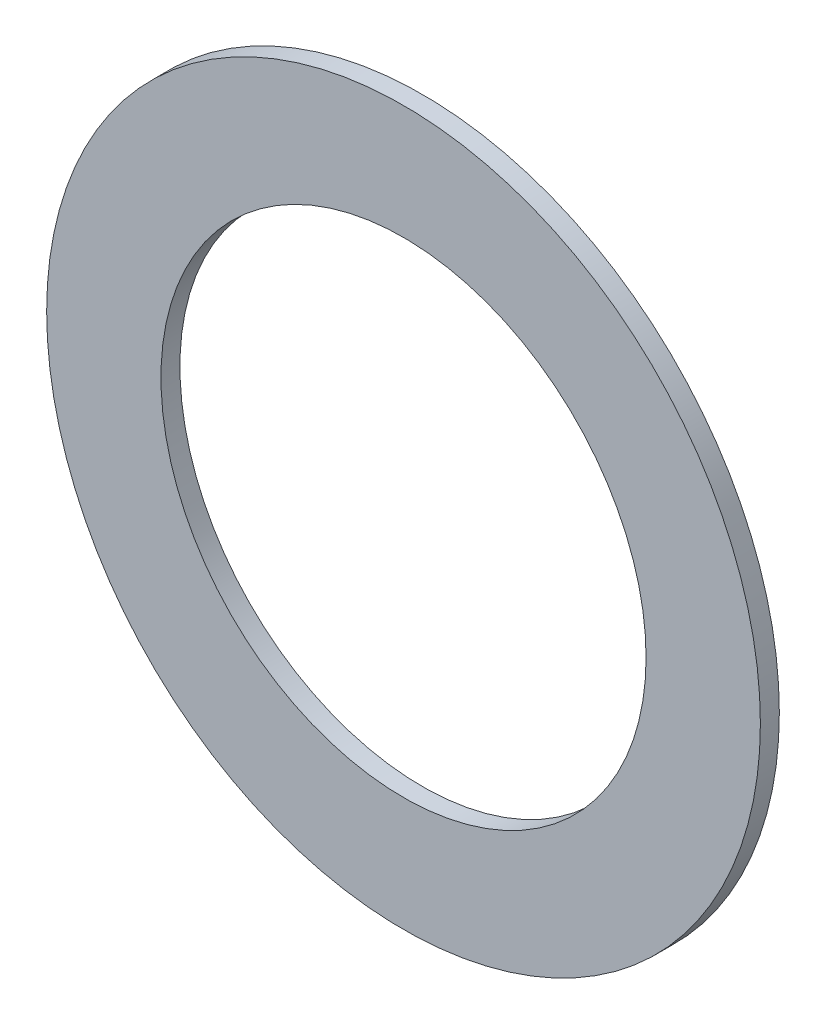
ISO-10303-21;
HEADER;
FILE_DESCRIPTION(('STEP AP214'),'2;1');
FILE_NAME('part.step','',(''),(''),'','','');
FILE_SCHEMA(('AUTOMOTIVE_DESIGN { 1 0 10303 214 1 1 1 1 }'));
ENDSEC;
DATA;
#1=APPLICATION_CONTEXT('core data for automotive mechanical design processes');
#2=APPLICATION_PROTOCOL_DEFINITION('international standard','automotive_design',2000,#1);
#3=PRODUCT_CONTEXT('',#1,'mechanical');
#4=PRODUCT('Part','Part','',(#3));
#5=PRODUCT_RELATED_PRODUCT_CATEGORY('part','',(#4));
#6=PRODUCT_DEFINITION_FORMATION('','',#4);
#7=PRODUCT_DEFINITION_CONTEXT('part definition',#1,'design');
#8=PRODUCT_DEFINITION('design','',#6,#7);
#9=PRODUCT_DEFINITION_SHAPE('','',#8);
#10=(LENGTH_UNIT() NAMED_UNIT(*) SI_UNIT(.MILLI.,.METRE.));
#11=(NAMED_UNIT(*) PLANE_ANGLE_UNIT() SI_UNIT($,.RADIAN.));
#12=(NAMED_UNIT(*) SI_UNIT($,.STERADIAN.) SOLID_ANGLE_UNIT());
#13=UNCERTAINTY_MEASURE_WITH_UNIT(LENGTH_MEASURE(1.E-05),#10,'distance_accuracy_value','');
#14=(GEOMETRIC_REPRESENTATION_CONTEXT(3) GLOBAL_UNCERTAINTY_ASSIGNED_CONTEXT((#13)) GLOBAL_UNIT_ASSIGNED_CONTEXT((#10,
#11,#12)) REPRESENTATION_CONTEXT('',''));
#15=CARTESIAN_POINT('',(0.,0.,0.));
#16=DIRECTION('',(0.,0.,1.));
#17=DIRECTION('',(1.,0.,0.));
#18=AXIS2_PLACEMENT_3D('',#15,#16,#17);
#19=CARTESIAN_POINT('',(0.,0.,6.8));
#20=DIRECTION('',(0.,0.,1.));
#21=DIRECTION('',(1.,0.,0.));
#22=AXIS2_PLACEMENT_3D('',#19,#20,#21);
#23=PLANE('',#22);
#24=CARTESIAN_POINT('',(0.,0.,6.8));
#25=DIRECTION('',(0.,0.,1.));
#26=DIRECTION('',(1.,0.,0.));
#27=AXIS2_PLACEMENT_3D('',#24,#25,#26);
#28=CIRCLE('',#27,128.);
#29=CARTESIAN_POINT('',(128.,0.,6.8));
#30=VERTEX_POINT('',#29);
#31=EDGE_CURVE('E11',#30,#30,#28,.T.);
#32=ORIENTED_EDGE('',*,*,#31,.T.);
#33=EDGE_LOOP('',(#32));
#34=FACE_BOUND('',#33,.T.);
#35=CARTESIAN_POINT('',(0.,0.,6.8));
#36=DIRECTION('',(0.,0.,1.));
#37=DIRECTION('',(1.,0.,0.));
#38=AXIS2_PLACEMENT_3D('',#35,#36,#37);
#39=CIRCLE('',#38,87.);
#40=CARTESIAN_POINT('',(87.,0.,6.8));
#41=VERTEX_POINT('',#40);
#42=EDGE_CURVE('E52',#41,#41,#39,.T.);
#43=ORIENTED_EDGE('',*,*,#42,.F.);
#44=EDGE_LOOP('',(#43));
#45=FACE_BOUND('',#44,.T.);
#46=ADVANCED_FACE('F41',(#34,#45),#23,.T.);
#47=CARTESIAN_POINT('',(0.,0.,0.));
#48=DIRECTION('',(0.,0.,1.));
#49=DIRECTION('',(1.,0.,0.));
#50=AXIS2_PLACEMENT_3D('',#47,#48,#49);
#51=PLANE('',#50);
#52=CARTESIAN_POINT('',(0.,0.,0.));
#53=DIRECTION('',(0.,0.,1.));
#54=DIRECTION('',(1.,0.,0.));
#55=AXIS2_PLACEMENT_3D('',#52,#53,#54);
#56=CIRCLE('',#55,128.);
#57=CARTESIAN_POINT('',(128.,0.,0.));
#58=VERTEX_POINT('',#57);
#59=EDGE_CURVE('E45',#58,#58,#56,.T.);
#60=ORIENTED_EDGE('',*,*,#59,.F.);
#61=EDGE_LOOP('',(#60));
#62=FACE_BOUND('',#61,.T.);
#63=CARTESIAN_POINT('',(0.,0.,0.));
#64=DIRECTION('',(0.,0.,1.));
#65=DIRECTION('',(1.,0.,0.));
#66=AXIS2_PLACEMENT_3D('',#63,#64,#65);
#67=CIRCLE('',#66,87.);
#68=CARTESIAN_POINT('',(87.,0.,0.));
#69=VERTEX_POINT('',#68);
#70=EDGE_CURVE('E54',#69,#69,#67,.T.);
#71=ORIENTED_EDGE('',*,*,#70,.T.);
#72=EDGE_LOOP('',(#71));
#73=FACE_BOUND('',#72,.T.);
#74=ADVANCED_FACE('F64',(#62,#73),#51,.F.);
#75=CARTESIAN_POINT('',(0.,0.,6.8));
#76=DIRECTION('',(0.,0.,-1.));
#77=DIRECTION('',(-1.,0.,0.));
#78=AXIS2_PLACEMENT_3D('',#75,#76,#77);
#79=CYLINDRICAL_SURFACE('',#78,128.);
#80=ORIENTED_EDGE('',*,*,#31,.F.);
#81=EDGE_LOOP('',(#80));
#82=FACE_BOUND('',#81,.T.);
#83=ORIENTED_EDGE('',*,*,#59,.T.);
#84=EDGE_LOOP('',(#83));
#85=FACE_BOUND('',#84,.T.);
#86=ADVANCED_FACE('F43',(#82,#85),#79,.T.);
#87=CARTESIAN_POINT('',(0.,0.,6.8));
#88=DIRECTION('',(0.,0.,-1.));
#89=DIRECTION('',(-1.,0.,0.));
#90=AXIS2_PLACEMENT_3D('',#87,#88,#89);
#91=CYLINDRICAL_SURFACE('',#90,87.);
#92=ORIENTED_EDGE('',*,*,#42,.T.);
#93=EDGE_LOOP('',(#92));
#94=FACE_BOUND('',#93,.T.);
#95=ORIENTED_EDGE('',*,*,#70,.F.);
#96=EDGE_LOOP('',(#95));
#97=FACE_BOUND('',#96,.T.);
#98=ADVANCED_FACE('F60',(#94,#97),#91,.F.);
#99=CLOSED_SHELL('',(#46,#74,#86,#98));
#100=MANIFOLD_SOLID_BREP('B2',#99);
#101=ADVANCED_BREP_SHAPE_REPRESENTATION('',(#18,#100),#14);
#102=SHAPE_DEFINITION_REPRESENTATION(#9,#101);
ENDSEC;
END-ISO-10303-21;
